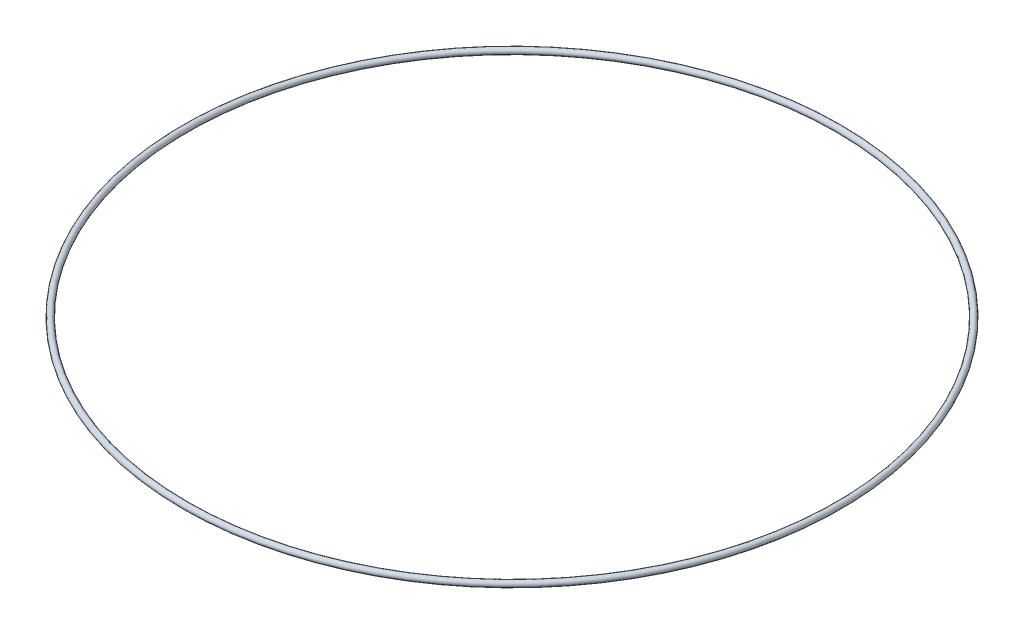
ISO-10303-21;
HEADER;
FILE_DESCRIPTION(('STEP AP214'),'2;1');
FILE_NAME('part.step','',(''),(''),'','','');
FILE_SCHEMA(('AUTOMOTIVE_DESIGN { 1 0 10303 214 1 1 1 1 }'));
ENDSEC;
DATA;
#1=APPLICATION_CONTEXT('core data for automotive mechanical design processes');
#2=APPLICATION_PROTOCOL_DEFINITION('international standard','automotive_design',2000,#1);
#3=PRODUCT_CONTEXT('',#1,'mechanical');
#4=PRODUCT('Part','Part','',(#3));
#5=PRODUCT_RELATED_PRODUCT_CATEGORY('part','',(#4));
#6=PRODUCT_DEFINITION_FORMATION('','',#4);
#7=PRODUCT_DEFINITION_CONTEXT('part definition',#1,'design');
#8=PRODUCT_DEFINITION('design','',#6,#7);
#9=PRODUCT_DEFINITION_SHAPE('','',#8);
#10=(LENGTH_UNIT() NAMED_UNIT(*) SI_UNIT(.MILLI.,.METRE.));
#11=(NAMED_UNIT(*) PLANE_ANGLE_UNIT() SI_UNIT($,.RADIAN.));
#12=(NAMED_UNIT(*) SI_UNIT($,.STERADIAN.) SOLID_ANGLE_UNIT());
#13=UNCERTAINTY_MEASURE_WITH_UNIT(LENGTH_MEASURE(1.E-05),#10,'distance_accuracy_value','');
#14=(GEOMETRIC_REPRESENTATION_CONTEXT(3) GLOBAL_UNCERTAINTY_ASSIGNED_CONTEXT((#13)) GLOBAL_UNIT_ASSIGNED_CONTEXT((#10,
#11,#12)) REPRESENTATION_CONTEXT('',''));
#15=CARTESIAN_POINT('',(0.,0.,0.));
#16=DIRECTION('',(0.,0.,1.));
#17=DIRECTION('',(1.,0.,0.));
#18=AXIS2_PLACEMENT_3D('',#15,#16,#17);
#19=CARTESIAN_POINT('',(0.,0.,0.));
#20=DIRECTION('',(0.,-1.,0.));
#21=DIRECTION('',(0.,0.,-1.));
#22=AXIS2_PLACEMENT_3D('',#19,#20,#21);
#23=TOROIDAL_SURFACE('',#22,96.52,0.889000000000003);
#24=CARTESIAN_POINT('',(0.,0.,-97.409));
#25=VERTEX_POINT('',#24);
#26=VERTEX_LOOP('',#25);
#27=FACE_BOUND('',#26,.T.);
#28=ADVANCED_FACE('F33',(#27),#23,.T.);
#29=CLOSED_SHELL('',(#28));
#30=MANIFOLD_SOLID_BREP('B2',#29);
#31=ADVANCED_BREP_SHAPE_REPRESENTATION('',(#18,#30),#14);
#32=SHAPE_DEFINITION_REPRESENTATION(#9,#31);
ENDSEC;
END-ISO-10303-21;
